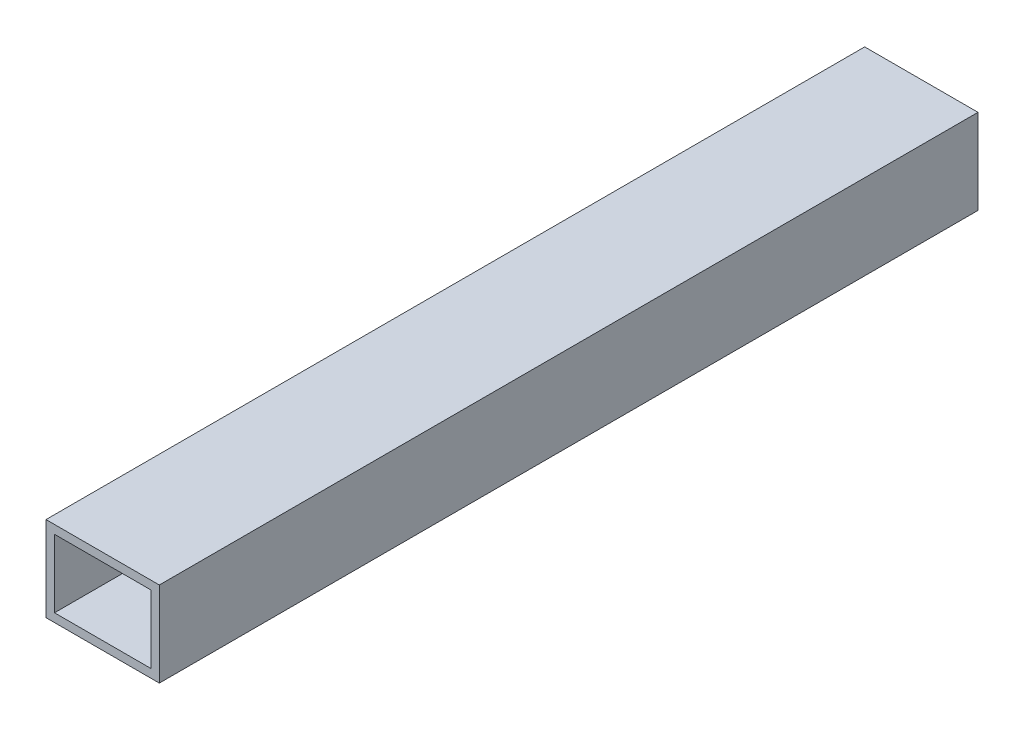
ISO-10303-21;
HEADER;
FILE_DESCRIPTION(('STEP AP214'),'2;1');
FILE_NAME('part.step','',(''),(''),'','','');
FILE_SCHEMA(('AUTOMOTIVE_DESIGN { 1 0 10303 214 1 1 1 1 }'));
ENDSEC;
DATA;
#1=APPLICATION_CONTEXT('core data for automotive mechanical design processes');
#2=APPLICATION_PROTOCOL_DEFINITION('international standard','automotive_design',2000,#1);
#3=PRODUCT_CONTEXT('',#1,'mechanical');
#4=PRODUCT('Part','Part','',(#3));
#5=PRODUCT_RELATED_PRODUCT_CATEGORY('part','',(#4));
#6=PRODUCT_DEFINITION_FORMATION('','',#4);
#7=PRODUCT_DEFINITION_CONTEXT('part definition',#1,'design');
#8=PRODUCT_DEFINITION('design','',#6,#7);
#9=PRODUCT_DEFINITION_SHAPE('','',#8);
#10=(LENGTH_UNIT() NAMED_UNIT(*) SI_UNIT(.MILLI.,.METRE.));
#11=(NAMED_UNIT(*) PLANE_ANGLE_UNIT() SI_UNIT($,.RADIAN.));
#12=(NAMED_UNIT(*) SI_UNIT($,.STERADIAN.) SOLID_ANGLE_UNIT());
#13=UNCERTAINTY_MEASURE_WITH_UNIT(LENGTH_MEASURE(1.E-05),#10,'distance_accuracy_value','');
#14=(GEOMETRIC_REPRESENTATION_CONTEXT(3) GLOBAL_UNCERTAINTY_ASSIGNED_CONTEXT((#13)) GLOBAL_UNIT_ASSIGNED_CONTEXT((#10,
#11,#12)) REPRESENTATION_CONTEXT('',''));
#15=CARTESIAN_POINT('',(0.,0.,0.));
#16=DIRECTION('',(0.,0.,1.));
#17=DIRECTION('',(1.,0.,0.));
#18=AXIS2_PLACEMENT_3D('',#15,#16,#17);
#19=CARTESIAN_POINT('',(40.,-15.,144.5));
#20=DIRECTION('',(0.,1.,0.));
#21=DIRECTION('',(0.,0.,1.));
#22=AXIS2_PLACEMENT_3D('',#19,#20,#21);
#23=PLANE('',#22);
#24=DIRECTION('',(0.,0.,-1.));
#25=VECTOR('',#24,1.);
#26=CARTESIAN_POINT('',(0.,-15.,144.5));
#27=LINE('',#26,#25);
#28=CARTESIAN_POINT('',(0.,-15.,144.5));
#29=VERTEX_POINT('',#28);
#30=CARTESIAN_POINT('',(0.,-15.,-144.5));
#31=VERTEX_POINT('',#30);
#32=EDGE_CURVE('E134',#29,#31,#27,.T.);
#33=ORIENTED_EDGE('',*,*,#32,.T.);
#34=DIRECTION('',(-1.,0.,0.));
#35=VECTOR('',#34,1.);
#36=CARTESIAN_POINT('',(40.,-15.,-144.5));
#37=LINE('',#36,#35);
#38=CARTESIAN_POINT('',(40.,-15.,-144.5));
#39=VERTEX_POINT('',#38);
#40=EDGE_CURVE('E11',#39,#31,#37,.T.);
#41=ORIENTED_EDGE('',*,*,#40,.F.);
#42=DIRECTION('',(0.,0.,-1.));
#43=VECTOR('',#42,1.);
#44=CARTESIAN_POINT('',(40.,-15.,144.5));
#45=LINE('',#44,#43);
#46=CARTESIAN_POINT('',(40.,-15.,144.5));
#47=VERTEX_POINT('',#46);
#48=EDGE_CURVE('E135',#47,#39,#45,.T.);
#49=ORIENTED_EDGE('',*,*,#48,.F.);
#50=DIRECTION('',(-1.,0.,0.));
#51=VECTOR('',#50,1.);
#52=CARTESIAN_POINT('',(40.,-15.,144.5));
#53=LINE('',#52,#51);
#54=EDGE_CURVE('E145',#47,#29,#53,.T.);
#55=ORIENTED_EDGE('',*,*,#54,.T.);
#56=EDGE_LOOP('',(#33,#41,#49,#55));
#57=FACE_BOUND('',#56,.T.);
#58=ADVANCED_FACE('F33',(#57),#23,.F.);
#59=CARTESIAN_POINT('',(40.,-15.,-144.5));
#60=DIRECTION('',(0.,0.,1.));
#61=DIRECTION('',(1.,0.,0.));
#62=AXIS2_PLACEMENT_3D('',#59,#60,#61);
#63=PLANE('',#62);
#64=DIRECTION('',(-1.,0.,0.));
#65=VECTOR('',#64,1.);
#66=CARTESIAN_POINT('',(40.,12.,-144.5));
#67=LINE('',#66,#65);
#68=CARTESIAN_POINT('',(37.,12.,-144.5));
#69=VERTEX_POINT('',#68);
#70=CARTESIAN_POINT('',(2.99999999999999,12.,-144.5));
#71=VERTEX_POINT('',#70);
#72=EDGE_CURVE('E128',#69,#71,#67,.T.);
#73=ORIENTED_EDGE('',*,*,#72,.T.);
#74=DIRECTION('',(0.,-1.,0.));
#75=VECTOR('',#74,1.);
#76=CARTESIAN_POINT('',(3.,-15.,-144.5));
#77=LINE('',#76,#75);
#78=CARTESIAN_POINT('',(3.,-12.,-144.5));
#79=VERTEX_POINT('',#78);
#80=EDGE_CURVE('E131',#71,#79,#77,.T.);
#81=ORIENTED_EDGE('',*,*,#80,.T.);
#82=DIRECTION('',(1.,0.,0.));
#83=VECTOR('',#82,1.);
#84=CARTESIAN_POINT('',(40.,-12.,-144.5));
#85=LINE('',#84,#83);
#86=CARTESIAN_POINT('',(37.,-12.,-144.5));
#87=VERTEX_POINT('',#86);
#88=EDGE_CURVE('E123',#79,#87,#85,.T.);
#89=ORIENTED_EDGE('',*,*,#88,.T.);
#90=DIRECTION('',(0.,1.,0.));
#91=VECTOR('',#90,1.);
#92=CARTESIAN_POINT('',(37.,-15.,-144.5));
#93=LINE('',#92,#91);
#94=EDGE_CURVE('E103',#87,#69,#93,.T.);
#95=ORIENTED_EDGE('',*,*,#94,.T.);
#96=EDGE_LOOP('',(#73,#81,#89,#95));
#97=FACE_BOUND('',#96,.T.);
#98=DIRECTION('',(0.,1.,0.));
#99=VECTOR('',#98,1.);
#100=CARTESIAN_POINT('',(0.,-15.,-144.5));
#101=LINE('',#100,#99);
#102=CARTESIAN_POINT('',(0.,15.,-144.5));
#103=VERTEX_POINT('',#102);
#104=EDGE_CURVE('E148',#31,#103,#101,.T.);
#105=ORIENTED_EDGE('',*,*,#104,.T.);
#106=DIRECTION('',(-1.,0.,0.));
#107=VECTOR('',#106,1.);
#108=CARTESIAN_POINT('',(40.,15.,-144.5));
#109=LINE('',#108,#107);
#110=CARTESIAN_POINT('',(40.,15.,-144.5));
#111=VERTEX_POINT('',#110);
#112=EDGE_CURVE('E40',#111,#103,#109,.T.);
#113=ORIENTED_EDGE('',*,*,#112,.F.);
#114=DIRECTION('',(0.,1.,0.));
#115=VECTOR('',#114,1.);
#116=CARTESIAN_POINT('',(40.,-15.,-144.5));
#117=LINE('',#116,#115);
#118=EDGE_CURVE('E138',#39,#111,#117,.T.);
#119=ORIENTED_EDGE('',*,*,#118,.F.);
#120=ORIENTED_EDGE('',*,*,#40,.T.);
#121=EDGE_LOOP('',(#105,#113,#119,#120));
#122=FACE_BOUND('',#121,.T.);
#123=ADVANCED_FACE('F176',(#97,#122),#63,.F.);
#124=CARTESIAN_POINT('',(40.,15.,144.5));
#125=DIRECTION('',(0.,-1.,0.));
#126=DIRECTION('',(0.,0.,-1.));
#127=AXIS2_PLACEMENT_3D('',#124,#125,#126);
#128=PLANE('',#127);
#129=DIRECTION('',(0.,0.,1.));
#130=VECTOR('',#129,1.);
#131=CARTESIAN_POINT('',(0.,15.,144.5));
#132=LINE('',#131,#130);
#133=CARTESIAN_POINT('',(0.,15.,144.5));
#134=VERTEX_POINT('',#133);
#135=EDGE_CURVE('E150',#103,#134,#132,.T.);
#136=ORIENTED_EDGE('',*,*,#135,.T.);
#137=DIRECTION('',(-1.,0.,0.));
#138=VECTOR('',#137,1.);
#139=CARTESIAN_POINT('',(40.,15.,144.5));
#140=LINE('',#139,#138);
#141=CARTESIAN_POINT('',(40.,15.,144.5));
#142=VERTEX_POINT('',#141);
#143=EDGE_CURVE('E155',#142,#134,#140,.T.);
#144=ORIENTED_EDGE('',*,*,#143,.F.);
#145=DIRECTION('',(0.,0.,1.));
#146=VECTOR('',#145,1.);
#147=CARTESIAN_POINT('',(40.,15.,144.5));
#148=LINE('',#147,#146);
#149=EDGE_CURVE('E141',#111,#142,#148,.T.);
#150=ORIENTED_EDGE('',*,*,#149,.F.);
#151=ORIENTED_EDGE('',*,*,#112,.T.);
#152=EDGE_LOOP('',(#136,#144,#150,#151));
#153=FACE_BOUND('',#152,.T.);
#154=ADVANCED_FACE('F162',(#153),#128,.F.);
#155=CARTESIAN_POINT('',(40.,-15.,144.5));
#156=DIRECTION('',(0.,0.,-1.));
#157=DIRECTION('',(-1.,0.,0.));
#158=AXIS2_PLACEMENT_3D('',#155,#156,#157);
#159=PLANE('',#158);
#160=DIRECTION('',(1.,0.,0.));
#161=VECTOR('',#160,1.);
#162=CARTESIAN_POINT('',(3.,-12.,144.5));
#163=LINE('',#162,#161);
#164=CARTESIAN_POINT('',(3.,-12.,144.5));
#165=VERTEX_POINT('',#164);
#166=CARTESIAN_POINT('',(37.,-12.,144.5));
#167=VERTEX_POINT('',#166);
#168=EDGE_CURVE('E109',#165,#167,#163,.T.);
#169=ORIENTED_EDGE('',*,*,#168,.F.);
#170=DIRECTION('',(0.,-1.,0.));
#171=VECTOR('',#170,1.);
#172=CARTESIAN_POINT('',(3.,-12.,144.5));
#173=LINE('',#172,#171);
#174=CARTESIAN_POINT('',(2.99999999999999,12.,144.5));
#175=VERTEX_POINT('',#174);
#176=EDGE_CURVE('E55',#175,#165,#173,.T.);
#177=ORIENTED_EDGE('',*,*,#176,.F.);
#178=DIRECTION('',(-1.,0.,0.));
#179=VECTOR('',#178,1.);
#180=CARTESIAN_POINT('',(2.99999999999999,12.,144.5));
#181=LINE('',#180,#179);
#182=CARTESIAN_POINT('',(37.,12.,144.5));
#183=VERTEX_POINT('',#182);
#184=EDGE_CURVE('E116',#183,#175,#181,.T.);
#185=ORIENTED_EDGE('',*,*,#184,.F.);
#186=DIRECTION('',(0.,1.,0.));
#187=VECTOR('',#186,1.);
#188=CARTESIAN_POINT('',(37.,-12.,144.5));
#189=LINE('',#188,#187);
#190=EDGE_CURVE('E100',#167,#183,#189,.T.);
#191=ORIENTED_EDGE('',*,*,#190,.F.);
#192=EDGE_LOOP('',(#169,#177,#185,#191));
#193=FACE_BOUND('',#192,.T.);
#194=DIRECTION('',(0.,-1.,0.));
#195=VECTOR('',#194,1.);
#196=CARTESIAN_POINT('',(0.,-15.,144.5));
#197=LINE('',#196,#195);
#198=EDGE_CURVE('E139',#134,#29,#197,.T.);
#199=ORIENTED_EDGE('',*,*,#198,.T.);
#200=ORIENTED_EDGE('',*,*,#54,.F.);
#201=DIRECTION('',(0.,-1.,0.));
#202=VECTOR('',#201,1.);
#203=CARTESIAN_POINT('',(40.,-15.,144.5));
#204=LINE('',#203,#202);
#205=EDGE_CURVE('E143',#142,#47,#204,.T.);
#206=ORIENTED_EDGE('',*,*,#205,.F.);
#207=ORIENTED_EDGE('',*,*,#143,.T.);
#208=EDGE_LOOP('',(#199,#200,#206,#207));
#209=FACE_BOUND('',#208,.T.);
#210=ADVANCED_FACE('F113',(#193,#209),#159,.F.);
#211=CARTESIAN_POINT('',(40.,0.,0.));
#212=DIRECTION('',(1.,0.,0.));
#213=DIRECTION('',(0.,0.,-1.));
#214=AXIS2_PLACEMENT_3D('',#211,#212,#213);
#215=PLANE('',#214);
#216=ORIENTED_EDGE('',*,*,#48,.T.);
#217=ORIENTED_EDGE('',*,*,#118,.T.);
#218=ORIENTED_EDGE('',*,*,#149,.T.);
#219=ORIENTED_EDGE('',*,*,#205,.T.);
#220=EDGE_LOOP('',(#216,#217,#218,#219));
#221=FACE_BOUND('',#220,.T.);
#222=ADVANCED_FACE('F175',(#221),#215,.T.);
#223=CARTESIAN_POINT('',(0.,0.,0.));
#224=DIRECTION('',(1.,0.,0.));
#225=DIRECTION('',(0.,0.,-1.));
#226=AXIS2_PLACEMENT_3D('',#223,#224,#225);
#227=PLANE('',#226);
#228=ORIENTED_EDGE('',*,*,#32,.F.);
#229=ORIENTED_EDGE('',*,*,#198,.F.);
#230=ORIENTED_EDGE('',*,*,#135,.F.);
#231=ORIENTED_EDGE('',*,*,#104,.F.);
#232=EDGE_LOOP('',(#228,#229,#230,#231));
#233=FACE_BOUND('',#232,.T.);
#234=ADVANCED_FACE('F168',(#233),#227,.F.);
#235=CARTESIAN_POINT('',(3.,-12.,-745.5));
#236=DIRECTION('',(-1.,0.,0.));
#237=DIRECTION('',(0.,-1.,0.));
#238=AXIS2_PLACEMENT_3D('',#235,#236,#237);
#239=PLANE('',#238);
#240=DIRECTION('',(0.,0.,1.));
#241=VECTOR('',#240,1.);
#242=CARTESIAN_POINT('',(2.99999999999999,12.,-745.5));
#243=LINE('',#242,#241);
#244=EDGE_CURVE('E121',#71,#175,#243,.T.);
#245=ORIENTED_EDGE('',*,*,#244,.T.);
#246=ORIENTED_EDGE('',*,*,#176,.T.);
#247=DIRECTION('',(0.,0.,1.));
#248=VECTOR('',#247,1.);
#249=CARTESIAN_POINT('',(3.,-12.,-745.5));
#250=LINE('',#249,#248);
#251=EDGE_CURVE('E106',#79,#165,#250,.T.);
#252=ORIENTED_EDGE('',*,*,#251,.F.);
#253=ORIENTED_EDGE('',*,*,#80,.F.);
#254=EDGE_LOOP('',(#245,#246,#252,#253));
#255=FACE_BOUND('',#254,.T.);
#256=ADVANCED_FACE('F189',(#255),#239,.F.);
#257=CARTESIAN_POINT('',(2.99999999999999,12.,-745.5));
#258=DIRECTION('',(0.,1.,0.));
#259=DIRECTION('',(0.,0.,1.));
#260=AXIS2_PLACEMENT_3D('',#257,#258,#259);
#261=PLANE('',#260);
#262=DIRECTION('',(0.,0.,1.));
#263=VECTOR('',#262,1.);
#264=CARTESIAN_POINT('',(37.,12.,-745.5));
#265=LINE('',#264,#263);
#266=EDGE_CURVE('E105',#69,#183,#265,.T.);
#267=ORIENTED_EDGE('',*,*,#266,.T.);
#268=ORIENTED_EDGE('',*,*,#184,.T.);
#269=ORIENTED_EDGE('',*,*,#244,.F.);
#270=ORIENTED_EDGE('',*,*,#72,.F.);
#271=EDGE_LOOP('',(#267,#268,#269,#270));
#272=FACE_BOUND('',#271,.T.);
#273=ADVANCED_FACE('F194',(#272),#261,.F.);
#274=CARTESIAN_POINT('',(37.,-12.,-745.5));
#275=DIRECTION('',(1.,0.,0.));
#276=DIRECTION('',(0.,1.,0.));
#277=AXIS2_PLACEMENT_3D('',#274,#275,#276);
#278=PLANE('',#277);
#279=DIRECTION('',(0.,0.,1.));
#280=VECTOR('',#279,1.);
#281=CARTESIAN_POINT('',(37.,-12.,-745.5));
#282=LINE('',#281,#280);
#283=EDGE_CURVE('E47',#87,#167,#282,.T.);
#284=ORIENTED_EDGE('',*,*,#283,.T.);
#285=ORIENTED_EDGE('',*,*,#190,.T.);
#286=ORIENTED_EDGE('',*,*,#266,.F.);
#287=ORIENTED_EDGE('',*,*,#94,.F.);
#288=EDGE_LOOP('',(#284,#285,#286,#287));
#289=FACE_BOUND('',#288,.T.);
#290=ADVANCED_FACE('F97',(#289),#278,.F.);
#291=CARTESIAN_POINT('',(3.,-12.,-745.5));
#292=DIRECTION('',(0.,-1.,0.));
#293=DIRECTION('',(0.,0.,-1.));
#294=AXIS2_PLACEMENT_3D('',#291,#292,#293);
#295=PLANE('',#294);
#296=ORIENTED_EDGE('',*,*,#251,.T.);
#297=ORIENTED_EDGE('',*,*,#168,.T.);
#298=ORIENTED_EDGE('',*,*,#283,.F.);
#299=ORIENTED_EDGE('',*,*,#88,.F.);
#300=EDGE_LOOP('',(#296,#297,#298,#299));
#301=FACE_BOUND('',#300,.T.);
#302=ADVANCED_FACE('F110',(#301),#295,.F.);
#303=CLOSED_SHELL('',(#58,#123,#154,#210,#222,#234,#256,#273,#290,#302));
#304=MANIFOLD_SOLID_BREP('B2',#303);
#305=ADVANCED_BREP_SHAPE_REPRESENTATION('',(#18,#304),#14);
#306=SHAPE_DEFINITION_REPRESENTATION(#9,#305);
ENDSEC;
END-ISO-10303-21;
